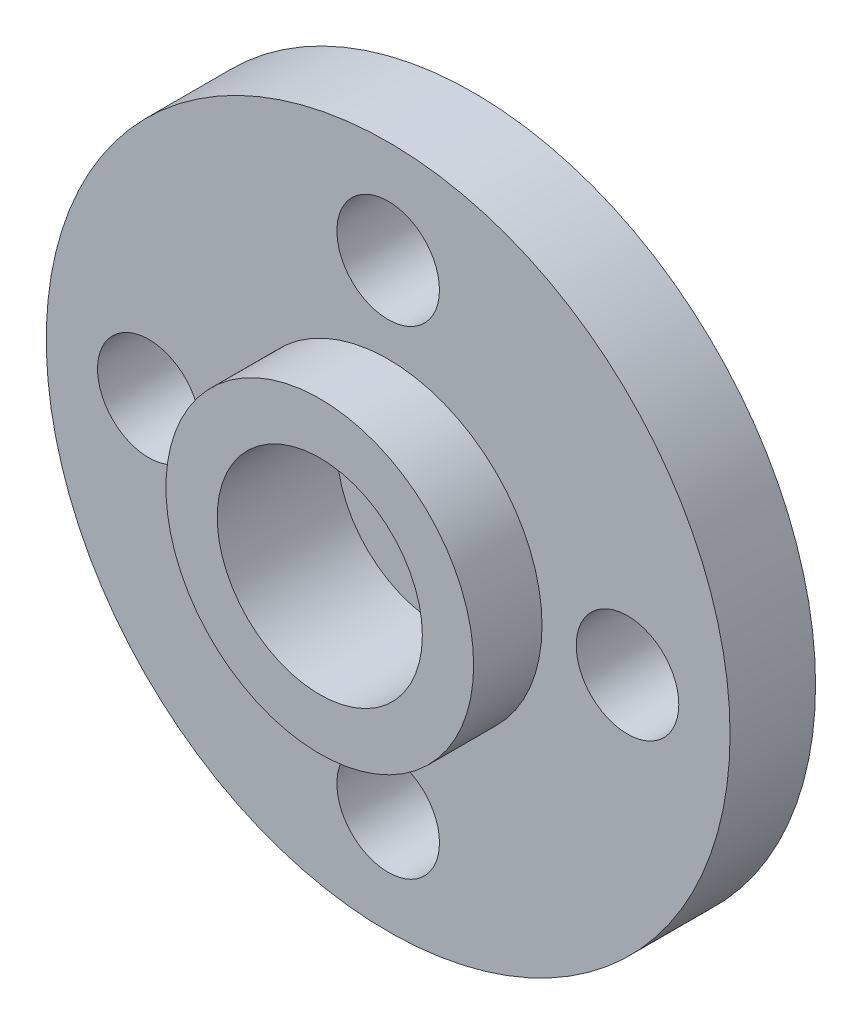
ISO-10303-21;
HEADER;
FILE_DESCRIPTION(('STEP AP214'),'2;1');
FILE_NAME('part.step','',(''),(''),'','','');
FILE_SCHEMA(('AUTOMOTIVE_DESIGN { 1 0 10303 214 1 1 1 1 }'));
ENDSEC;
DATA;
#1=APPLICATION_CONTEXT('core data for automotive mechanical design processes');
#2=APPLICATION_PROTOCOL_DEFINITION('international standard','automotive_design',2000,#1);
#3=PRODUCT_CONTEXT('',#1,'mechanical');
#4=PRODUCT('Part','Part','',(#3));
#5=PRODUCT_RELATED_PRODUCT_CATEGORY('part','',(#4));
#6=PRODUCT_DEFINITION_FORMATION('','',#4);
#7=PRODUCT_DEFINITION_CONTEXT('part definition',#1,'design');
#8=PRODUCT_DEFINITION('design','',#6,#7);
#9=PRODUCT_DEFINITION_SHAPE('','',#8);
#10=(LENGTH_UNIT() NAMED_UNIT(*) SI_UNIT(.MILLI.,.METRE.));
#11=(NAMED_UNIT(*) PLANE_ANGLE_UNIT() SI_UNIT($,.RADIAN.));
#12=(NAMED_UNIT(*) SI_UNIT($,.STERADIAN.) SOLID_ANGLE_UNIT());
#13=UNCERTAINTY_MEASURE_WITH_UNIT(LENGTH_MEASURE(1.E-05),#10,'distance_accuracy_value','');
#14=(GEOMETRIC_REPRESENTATION_CONTEXT(3) GLOBAL_UNCERTAINTY_ASSIGNED_CONTEXT((#13)) GLOBAL_UNIT_ASSIGNED_CONTEXT((#10,
#11,#12)) REPRESENTATION_CONTEXT('',''));
#15=CARTESIAN_POINT('',(0.,0.,0.));
#16=DIRECTION('',(0.,0.,1.));
#17=DIRECTION('',(1.,0.,0.));
#18=AXIS2_PLACEMENT_3D('',#15,#16,#17);
#19=CARTESIAN_POINT('',(0.,0.,2.5));
#20=DIRECTION('',(0.,0.,1.));
#21=DIRECTION('',(1.,0.,0.));
#22=AXIS2_PLACEMENT_3D('',#19,#20,#21);
#23=PLANE('',#22);
#24=CARTESIAN_POINT('',(0.,0.,2.5));
#25=DIRECTION('',(0.,0.,1.));
#26=DIRECTION('',(1.,0.,0.));
#27=AXIS2_PLACEMENT_3D('',#24,#25,#26);
#28=CIRCLE('',#27,4.5);
#29=CARTESIAN_POINT('',(4.5,0.,2.5));
#30=VERTEX_POINT('',#29);
#31=EDGE_CURVE('E86',#30,#30,#28,.T.);
#32=ORIENTED_EDGE('',*,*,#31,.F.);
#33=EDGE_LOOP('',(#32));
#34=FACE_BOUND('',#33,.T.);
#35=CARTESIAN_POINT('',(-7.,0.,2.5));
#36=DIRECTION('',(0.,0.,1.));
#37=DIRECTION('',(1.,0.,0.));
#38=AXIS2_PLACEMENT_3D('',#35,#36,#37);
#39=CIRCLE('',#38,1.5);
#40=CARTESIAN_POINT('',(-5.5,0.,2.5));
#41=VERTEX_POINT('',#40);
#42=EDGE_CURVE('E66',#41,#41,#39,.T.);
#43=ORIENTED_EDGE('',*,*,#42,.F.);
#44=EDGE_LOOP('',(#43));
#45=FACE_BOUND('',#44,.T.);
#46=CARTESIAN_POINT('',(0.,7.,2.5));
#47=DIRECTION('',(0.,0.,1.));
#48=DIRECTION('',(1.,0.,0.));
#49=AXIS2_PLACEMENT_3D('',#46,#47,#48);
#50=CIRCLE('',#49,1.5);
#51=CARTESIAN_POINT('',(1.5,7.,2.5));
#52=VERTEX_POINT('',#51);
#53=EDGE_CURVE('E52',#52,#52,#50,.T.);
#54=ORIENTED_EDGE('',*,*,#53,.F.);
#55=EDGE_LOOP('',(#54));
#56=FACE_BOUND('',#55,.T.);
#57=CARTESIAN_POINT('',(0.,0.,2.5));
#58=DIRECTION('',(0.,0.,1.));
#59=DIRECTION('',(1.,0.,0.));
#60=AXIS2_PLACEMENT_3D('',#57,#58,#59);
#61=CIRCLE('',#60,10.);
#62=CARTESIAN_POINT('',(10.,0.,2.5));
#63=VERTEX_POINT('',#62);
#64=EDGE_CURVE('E10',#63,#63,#61,.T.);
#65=ORIENTED_EDGE('',*,*,#64,.T.);
#66=EDGE_LOOP('',(#65));
#67=FACE_BOUND('',#66,.T.);
#68=CARTESIAN_POINT('',(0.,-7.,2.5));
#69=DIRECTION('',(0.,0.,1.));
#70=DIRECTION('',(1.,0.,0.));
#71=AXIS2_PLACEMENT_3D('',#68,#69,#70);
#72=CIRCLE('',#71,1.5);
#73=CARTESIAN_POINT('',(1.5,-7.,2.5));
#74=VERTEX_POINT('',#73);
#75=EDGE_CURVE('E58',#74,#74,#72,.T.);
#76=ORIENTED_EDGE('',*,*,#75,.F.);
#77=EDGE_LOOP('',(#76));
#78=FACE_BOUND('',#77,.T.);
#79=CARTESIAN_POINT('',(7.,0.,2.5));
#80=DIRECTION('',(0.,0.,1.));
#81=DIRECTION('',(1.,0.,0.));
#82=AXIS2_PLACEMENT_3D('',#79,#80,#81);
#83=CIRCLE('',#82,1.5);
#84=CARTESIAN_POINT('',(8.5,0.,2.5));
#85=VERTEX_POINT('',#84);
#86=EDGE_CURVE('E74',#85,#85,#83,.T.);
#87=ORIENTED_EDGE('',*,*,#86,.F.);
#88=EDGE_LOOP('',(#87));
#89=FACE_BOUND('',#88,.T.);
#90=ADVANCED_FACE('F37',(#34,#45,#56,#67,#78,#89),#23,.T.);
#91=CARTESIAN_POINT('',(0.,0.,0.));
#92=DIRECTION('',(0.,0.,1.));
#93=DIRECTION('',(1.,0.,0.));
#94=AXIS2_PLACEMENT_3D('',#91,#92,#93);
#95=PLANE('',#94);
#96=CARTESIAN_POINT('',(0.,0.,0.));
#97=DIRECTION('',(0.,0.,1.));
#98=DIRECTION('',(1.,0.,0.));
#99=AXIS2_PLACEMENT_3D('',#96,#97,#98);
#100=CIRCLE('',#99,1.5);
#101=CARTESIAN_POINT('',(1.5,0.,0.));
#102=VERTEX_POINT('',#101);
#103=EDGE_CURVE('E41',#102,#102,#100,.T.);
#104=ORIENTED_EDGE('',*,*,#103,.T.);
#105=EDGE_LOOP('',(#104));
#106=FACE_BOUND('',#105,.T.);
#107=CARTESIAN_POINT('',(0.,0.,0.));
#108=DIRECTION('',(0.,0.,1.));
#109=DIRECTION('',(1.,0.,0.));
#110=AXIS2_PLACEMENT_3D('',#107,#108,#109);
#111=CIRCLE('',#110,10.);
#112=CARTESIAN_POINT('',(10.,0.,0.));
#113=VERTEX_POINT('',#112);
#114=EDGE_CURVE('E46',#113,#113,#111,.T.);
#115=ORIENTED_EDGE('',*,*,#114,.F.);
#116=EDGE_LOOP('',(#115));
#117=FACE_BOUND('',#116,.T.);
#118=CARTESIAN_POINT('',(0.,7.,0.));
#119=DIRECTION('',(0.,0.,1.));
#120=DIRECTION('',(1.,0.,0.));
#121=AXIS2_PLACEMENT_3D('',#118,#119,#120);
#122=CIRCLE('',#121,1.5);
#123=CARTESIAN_POINT('',(1.5,7.,0.));
#124=VERTEX_POINT('',#123);
#125=EDGE_CURVE('E54',#124,#124,#122,.T.);
#126=ORIENTED_EDGE('',*,*,#125,.T.);
#127=EDGE_LOOP('',(#126));
#128=FACE_BOUND('',#127,.T.);
#129=CARTESIAN_POINT('',(0.,-7.,0.));
#130=DIRECTION('',(0.,0.,1.));
#131=DIRECTION('',(1.,0.,0.));
#132=AXIS2_PLACEMENT_3D('',#129,#130,#131);
#133=CIRCLE('',#132,1.5);
#134=CARTESIAN_POINT('',(1.5,-7.,0.));
#135=VERTEX_POINT('',#134);
#136=EDGE_CURVE('E62',#135,#135,#133,.T.);
#137=ORIENTED_EDGE('',*,*,#136,.T.);
#138=EDGE_LOOP('',(#137));
#139=FACE_BOUND('',#138,.T.);
#140=CARTESIAN_POINT('',(-7.,0.,0.));
#141=DIRECTION('',(0.,0.,1.));
#142=DIRECTION('',(1.,0.,0.));
#143=AXIS2_PLACEMENT_3D('',#140,#141,#142);
#144=CIRCLE('',#143,1.5);
#145=CARTESIAN_POINT('',(-5.5,0.,0.));
#146=VERTEX_POINT('',#145);
#147=EDGE_CURVE('E70',#146,#146,#144,.T.);
#148=ORIENTED_EDGE('',*,*,#147,.T.);
#149=EDGE_LOOP('',(#148));
#150=FACE_BOUND('',#149,.T.);
#151=CARTESIAN_POINT('',(7.,0.,0.));
#152=DIRECTION('',(0.,0.,1.));
#153=DIRECTION('',(1.,0.,0.));
#154=AXIS2_PLACEMENT_3D('',#151,#152,#153);
#155=CIRCLE('',#154,1.5);
#156=CARTESIAN_POINT('',(8.5,0.,0.));
#157=VERTEX_POINT('',#156);
#158=EDGE_CURVE('E78',#157,#157,#155,.T.);
#159=ORIENTED_EDGE('',*,*,#158,.T.);
#160=EDGE_LOOP('',(#159));
#161=FACE_BOUND('',#160,.T.);
#162=ADVANCED_FACE('F110',(#106,#117,#128,#139,#150,#161),#95,.F.);
#163=CARTESIAN_POINT('',(0.,0.,2.5));
#164=DIRECTION('',(0.,0.,-1.));
#165=DIRECTION('',(-1.,0.,0.));
#166=AXIS2_PLACEMENT_3D('',#163,#164,#165);
#167=CYLINDRICAL_SURFACE('',#166,10.);
#168=ORIENTED_EDGE('',*,*,#64,.F.);
#169=EDGE_LOOP('',(#168));
#170=FACE_BOUND('',#169,.T.);
#171=ORIENTED_EDGE('',*,*,#114,.T.);
#172=EDGE_LOOP('',(#171));
#173=FACE_BOUND('',#172,.T.);
#174=ADVANCED_FACE('F39',(#170,#173),#167,.T.);
#175=CARTESIAN_POINT('',(0.,7.,2.5));
#176=DIRECTION('',(0.,0.,-1.));
#177=DIRECTION('',(-1.,0.,0.));
#178=AXIS2_PLACEMENT_3D('',#175,#176,#177);
#179=CYLINDRICAL_SURFACE('',#178,1.5);
#180=ORIENTED_EDGE('',*,*,#53,.T.);
#181=EDGE_LOOP('',(#180));
#182=FACE_BOUND('',#181,.T.);
#183=ORIENTED_EDGE('',*,*,#125,.F.);
#184=EDGE_LOOP('',(#183));
#185=FACE_BOUND('',#184,.T.);
#186=ADVANCED_FACE('F134',(#182,#185),#179,.F.);
#187=CARTESIAN_POINT('',(0.,-7.,2.5));
#188=DIRECTION('',(0.,0.,-1.));
#189=DIRECTION('',(-1.,0.,0.));
#190=AXIS2_PLACEMENT_3D('',#187,#188,#189);
#191=CYLINDRICAL_SURFACE('',#190,1.5);
#192=ORIENTED_EDGE('',*,*,#75,.T.);
#193=EDGE_LOOP('',(#192));
#194=FACE_BOUND('',#193,.T.);
#195=ORIENTED_EDGE('',*,*,#136,.F.);
#196=EDGE_LOOP('',(#195));
#197=FACE_BOUND('',#196,.T.);
#198=ADVANCED_FACE('F137',(#194,#197),#191,.F.);
#199=CARTESIAN_POINT('',(-7.,0.,2.5));
#200=DIRECTION('',(0.,0.,-1.));
#201=DIRECTION('',(-1.,0.,0.));
#202=AXIS2_PLACEMENT_3D('',#199,#200,#201);
#203=CYLINDRICAL_SURFACE('',#202,1.5);
#204=ORIENTED_EDGE('',*,*,#42,.T.);
#205=EDGE_LOOP('',(#204));
#206=FACE_BOUND('',#205,.T.);
#207=ORIENTED_EDGE('',*,*,#147,.F.);
#208=EDGE_LOOP('',(#207));
#209=FACE_BOUND('',#208,.T.);
#210=ADVANCED_FACE('F141',(#206,#209),#203,.F.);
#211=CARTESIAN_POINT('',(7.,0.,2.5));
#212=DIRECTION('',(0.,0.,-1.));
#213=DIRECTION('',(-1.,0.,0.));
#214=AXIS2_PLACEMENT_3D('',#211,#212,#213);
#215=CYLINDRICAL_SURFACE('',#214,1.5);
#216=ORIENTED_EDGE('',*,*,#86,.T.);
#217=EDGE_LOOP('',(#216));
#218=FACE_BOUND('',#217,.T.);
#219=ORIENTED_EDGE('',*,*,#158,.F.);
#220=EDGE_LOOP('',(#219));
#221=FACE_BOUND('',#220,.T.);
#222=ADVANCED_FACE('F145',(#218,#221),#215,.F.);
#223=CARTESIAN_POINT('',(0.,0.,4.5));
#224=DIRECTION('',(0.,0.,-1.));
#225=DIRECTION('',(-1.,0.,0.));
#226=AXIS2_PLACEMENT_3D('',#223,#224,#225);
#227=CYLINDRICAL_SURFACE('',#226,4.5);
#228=CARTESIAN_POINT('',(0.,0.,4.5));
#229=DIRECTION('',(0.,0.,1.));
#230=DIRECTION('',(1.,0.,0.));
#231=AXIS2_PLACEMENT_3D('',#228,#229,#230);
#232=CIRCLE('',#231,4.5);
#233=CARTESIAN_POINT('',(4.5,0.,4.5));
#234=VERTEX_POINT('',#233);
#235=EDGE_CURVE('E82',#234,#234,#232,.T.);
#236=ORIENTED_EDGE('',*,*,#235,.F.);
#237=EDGE_LOOP('',(#236));
#238=FACE_BOUND('',#237,.T.);
#239=ORIENTED_EDGE('',*,*,#31,.T.);
#240=EDGE_LOOP('',(#239));
#241=FACE_BOUND('',#240,.T.);
#242=ADVANCED_FACE('F149',(#238,#241),#227,.T.);
#243=CARTESIAN_POINT('',(0.,0.,4.5));
#244=DIRECTION('',(0.,0.,1.));
#245=DIRECTION('',(1.,0.,0.));
#246=AXIS2_PLACEMENT_3D('',#243,#244,#245);
#247=PLANE('',#246);
#248=CARTESIAN_POINT('',(0.,0.,4.5));
#249=DIRECTION('',(0.,0.,1.));
#250=DIRECTION('',(1.,0.,0.));
#251=AXIS2_PLACEMENT_3D('',#248,#249,#250);
#252=CIRCLE('',#251,3.);
#253=CARTESIAN_POINT('',(3.,0.,4.5));
#254=VERTEX_POINT('',#253);
#255=EDGE_CURVE('E94',#254,#254,#252,.T.);
#256=ORIENTED_EDGE('',*,*,#255,.F.);
#257=EDGE_LOOP('',(#256));
#258=FACE_BOUND('',#257,.T.);
#259=ORIENTED_EDGE('',*,*,#235,.T.);
#260=EDGE_LOOP('',(#259));
#261=FACE_BOUND('',#260,.T.);
#262=ADVANCED_FACE('F153',(#258,#261),#247,.T.);
#263=CARTESIAN_POINT('',(0.,0.,1.));
#264=DIRECTION('',(0.,0.,1.));
#265=DIRECTION('',(1.,0.,0.));
#266=AXIS2_PLACEMENT_3D('',#263,#264,#265);
#267=CYLINDRICAL_SURFACE('',#266,3.);
#268=CARTESIAN_POINT('',(0.,0.,1.));
#269=DIRECTION('',(0.,0.,1.));
#270=DIRECTION('',(1.,0.,0.));
#271=AXIS2_PLACEMENT_3D('',#268,#269,#270);
#272=CIRCLE('',#271,3.);
#273=CARTESIAN_POINT('',(3.,0.,1.));
#274=VERTEX_POINT('',#273);
#275=EDGE_CURVE('E90',#274,#274,#272,.T.);
#276=ORIENTED_EDGE('',*,*,#275,.F.);
#277=EDGE_LOOP('',(#276));
#278=FACE_BOUND('',#277,.T.);
#279=ORIENTED_EDGE('',*,*,#255,.T.);
#280=EDGE_LOOP('',(#279));
#281=FACE_BOUND('',#280,.T.);
#282=ADVANCED_FACE('F120',(#278,#281),#267,.F.);
#283=CARTESIAN_POINT('',(0.,0.,1.));
#284=DIRECTION('',(0.,0.,1.));
#285=DIRECTION('',(1.,0.,0.));
#286=AXIS2_PLACEMENT_3D('',#283,#284,#285);
#287=PLANE('',#286);
#288=CARTESIAN_POINT('',(0.,0.,1.));
#289=DIRECTION('',(0.,0.,1.));
#290=DIRECTION('',(1.,0.,0.));
#291=AXIS2_PLACEMENT_3D('',#288,#289,#290);
#292=CIRCLE('',#291,1.5);
#293=CARTESIAN_POINT('',(1.5,0.,1.));
#294=VERTEX_POINT('',#293);
#295=EDGE_CURVE('E101',#294,#294,#292,.T.);
#296=ORIENTED_EDGE('',*,*,#295,.F.);
#297=EDGE_LOOP('',(#296));
#298=FACE_BOUND('',#297,.T.);
#299=ORIENTED_EDGE('',*,*,#275,.T.);
#300=EDGE_LOOP('',(#299));
#301=FACE_BOUND('',#300,.T.);
#302=ADVANCED_FACE('F115',(#298,#301),#287,.T.);
#303=CARTESIAN_POINT('',(0.,0.,-2.5));
#304=DIRECTION('',(0.,0.,1.));
#305=DIRECTION('',(1.,0.,0.));
#306=AXIS2_PLACEMENT_3D('',#303,#304,#305);
#307=CYLINDRICAL_SURFACE('',#306,1.5);
#308=ORIENTED_EDGE('',*,*,#295,.T.);
#309=EDGE_LOOP('',(#308));
#310=FACE_BOUND('',#309,.T.);
#311=ORIENTED_EDGE('',*,*,#103,.F.);
#312=EDGE_LOOP('',(#311));
#313=FACE_BOUND('',#312,.T.);
#314=ADVANCED_FACE('F113',(#310,#313),#307,.F.);
#315=CLOSED_SHELL('',(#90,#162,#174,#186,#198,#210,#222,#242,#262,#282,#302,#314));
#316=MANIFOLD_SOLID_BREP('B2',#315);
#317=ADVANCED_BREP_SHAPE_REPRESENTATION('',(#18,#316),#14);
#318=SHAPE_DEFINITION_REPRESENTATION(#9,#317);
ENDSEC;
END-ISO-10303-21;
